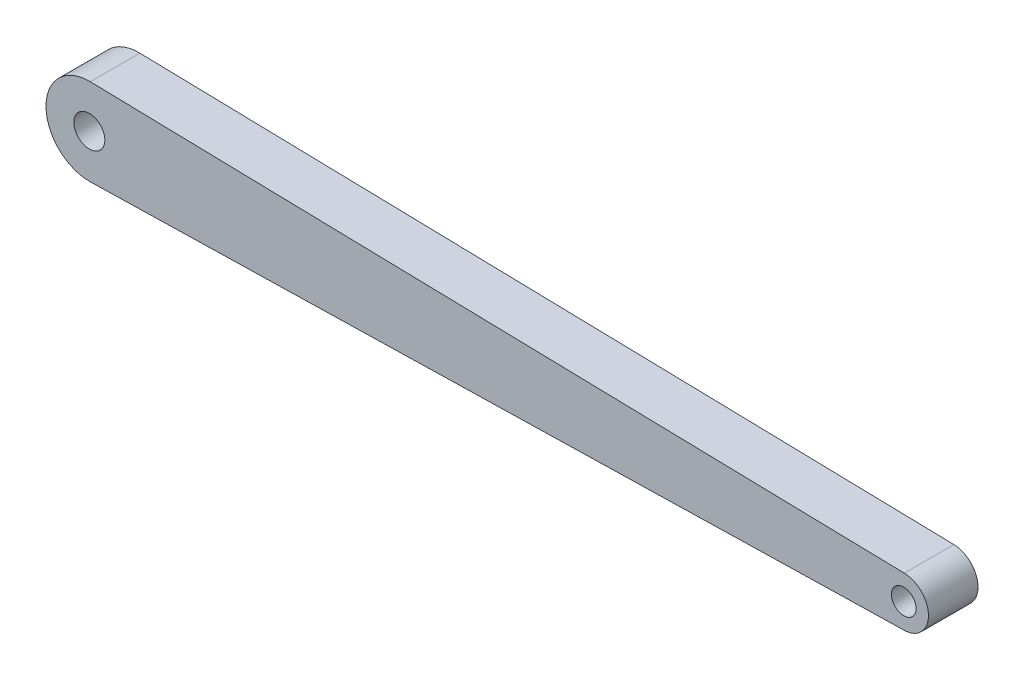
ISO-10303-21;
HEADER;
FILE_DESCRIPTION(('STEP AP214'),'2;1');
FILE_NAME('part.step','',(''),(''),'','','');
FILE_SCHEMA(('AUTOMOTIVE_DESIGN { 1 0 10303 214 1 1 1 1 }'));
ENDSEC;
DATA;
#1=APPLICATION_CONTEXT('core data for automotive mechanical design processes');
#2=APPLICATION_PROTOCOL_DEFINITION('international standard','automotive_design',2000,#1);
#3=PRODUCT_CONTEXT('',#1,'mechanical');
#4=PRODUCT('Part','Part','',(#3));
#5=PRODUCT_RELATED_PRODUCT_CATEGORY('part','',(#4));
#6=PRODUCT_DEFINITION_FORMATION('','',#4);
#7=PRODUCT_DEFINITION_CONTEXT('part definition',#1,'design');
#8=PRODUCT_DEFINITION('design','',#6,#7);
#9=PRODUCT_DEFINITION_SHAPE('','',#8);
#10=(LENGTH_UNIT() NAMED_UNIT(*) SI_UNIT(.MILLI.,.METRE.));
#11=(NAMED_UNIT(*) PLANE_ANGLE_UNIT() SI_UNIT($,.RADIAN.));
#12=(NAMED_UNIT(*) SI_UNIT($,.STERADIAN.) SOLID_ANGLE_UNIT());
#13=UNCERTAINTY_MEASURE_WITH_UNIT(LENGTH_MEASURE(1.E-05),#10,'distance_accuracy_value','');
#14=(GEOMETRIC_REPRESENTATION_CONTEXT(3) GLOBAL_UNCERTAINTY_ASSIGNED_CONTEXT((#13)) GLOBAL_UNIT_ASSIGNED_CONTEXT((#10,
#11,#12)) REPRESENTATION_CONTEXT('',''));
#15=CARTESIAN_POINT('',(0.,0.,0.));
#16=DIRECTION('',(0.,0.,1.));
#17=DIRECTION('',(1.,0.,0.));
#18=AXIS2_PLACEMENT_3D('',#15,#16,#17);
#19=CARTESIAN_POINT('',(-1315.,0.,40.));
#20=DIRECTION('',(0.,0.,1.));
#21=DIRECTION('',(1.,0.,0.));
#22=AXIS2_PLACEMENT_3D('',#19,#20,#21);
#23=PLANE('',#22);
#24=CARTESIAN_POINT('',(0.,0.,40.));
#25=DIRECTION('',(0.,0.,1.));
#26=DIRECTION('',(1.,0.,0.));
#27=AXIS2_PLACEMENT_3D('',#24,#25,#26);
#28=CIRCLE('',#27,20.);
#29=CARTESIAN_POINT('',(20.,0.,40.));
#30=VERTEX_POINT('',#29);
#31=EDGE_CURVE('E112',#30,#30,#28,.T.);
#32=ORIENTED_EDGE('',*,*,#31,.F.);
#33=EDGE_LOOP('',(#32));
#34=FACE_BOUND('',#33,.T.);
#35=CARTESIAN_POINT('',(-1315.,0.,40.));
#36=DIRECTION('',(0.,0.,1.));
#37=DIRECTION('',(1.,0.,0.));
#38=AXIS2_PLACEMENT_3D('',#35,#36,#37);
#39=CIRCLE('',#38,70.);
#40=CARTESIAN_POINT('',(-1313.40304182509,69.9817813762096,40.));
#41=VERTEX_POINT('',#40);
#42=CARTESIAN_POINT('',(-1313.40304182509,-69.9817813762097,40.));
#43=VERTEX_POINT('',#42);
#44=EDGE_CURVE('E92',#41,#43,#39,.T.);
#45=ORIENTED_EDGE('',*,*,#44,.T.);
#46=DIRECTION('',(0.999739733945852,0.0228136882129277,0.));
#47=VECTOR('',#46,1.);
#48=CARTESIAN_POINT('',(-1313.40304182509,-69.9817813762097,40.));
#49=LINE('',#48,#47);
#50=CARTESIAN_POINT('',(0.912547528517138,-39.9895893578341,40.));
#51=VERTEX_POINT('',#50);
#52=EDGE_CURVE('E87',#43,#51,#49,.T.);
#53=ORIENTED_EDGE('',*,*,#52,.T.);
#54=CARTESIAN_POINT('',(0.,0.,40.));
#55=DIRECTION('',(0.,0.,1.));
#56=DIRECTION('',(-1.,0.,0.));
#57=AXIS2_PLACEMENT_3D('',#54,#55,#56);
#58=CIRCLE('',#57,40.);
#59=CARTESIAN_POINT('',(0.912547528517112,39.9895893578341,40.));
#60=VERTEX_POINT('',#59);
#61=EDGE_CURVE('E90',#51,#60,#58,.T.);
#62=ORIENTED_EDGE('',*,*,#61,.T.);
#63=DIRECTION('',(-0.999739733945852,0.0228136882129278,0.));
#64=VECTOR('',#63,1.);
#65=CARTESIAN_POINT('',(-1313.40304182509,69.9817813762096,40.));
#66=LINE('',#65,#64);
#67=EDGE_CURVE('E57',#60,#41,#66,.T.);
#68=ORIENTED_EDGE('',*,*,#67,.T.);
#69=EDGE_LOOP('',(#45,#53,#62,#68));
#70=FACE_BOUND('',#69,.T.);
#71=CARTESIAN_POINT('',(-1315.,0.,40.));
#72=DIRECTION('',(0.,0.,1.));
#73=DIRECTION('',(1.,0.,0.));
#74=AXIS2_PLACEMENT_3D('',#71,#72,#73);
#75=CIRCLE('',#74,25.);
#76=CARTESIAN_POINT('',(-1290.,0.,40.));
#77=VERTEX_POINT('',#76);
#78=EDGE_CURVE('E134',#77,#77,#75,.T.);
#79=ORIENTED_EDGE('',*,*,#78,.F.);
#80=EDGE_LOOP('',(#79));
#81=FACE_BOUND('',#80,.T.);
#82=ADVANCED_FACE('F39',(#34,#70,#81),#23,.T.);
#83=CARTESIAN_POINT('',(-1315.,0.,-40.));
#84=DIRECTION('',(0.,0.,1.));
#85=DIRECTION('',(1.,0.,0.));
#86=AXIS2_PLACEMENT_3D('',#83,#84,#85);
#87=PLANE('',#86);
#88=CARTESIAN_POINT('',(-1315.,0.,-40.));
#89=DIRECTION('',(0.,0.,1.));
#90=DIRECTION('',(1.,0.,0.));
#91=AXIS2_PLACEMENT_3D('',#88,#89,#90);
#92=CIRCLE('',#91,70.);
#93=CARTESIAN_POINT('',(-1313.40304182509,69.9817813762096,-40.));
#94=VERTEX_POINT('',#93);
#95=CARTESIAN_POINT('',(-1313.40304182509,-69.9817813762097,-40.));
#96=VERTEX_POINT('',#95);
#97=EDGE_CURVE('E108',#94,#96,#92,.T.);
#98=ORIENTED_EDGE('',*,*,#97,.F.);
#99=DIRECTION('',(-0.999739733945852,0.0228136882129278,0.));
#100=VECTOR('',#99,1.);
#101=CARTESIAN_POINT('',(-1313.40304182509,69.9817813762096,-40.));
#102=LINE('',#101,#100);
#103=CARTESIAN_POINT('',(0.912547528517112,39.9895893578341,-40.));
#104=VERTEX_POINT('',#103);
#105=EDGE_CURVE('E80',#104,#94,#102,.T.);
#106=ORIENTED_EDGE('',*,*,#105,.F.);
#107=CARTESIAN_POINT('',(0.,0.,-40.));
#108=DIRECTION('',(0.,0.,1.));
#109=DIRECTION('',(-1.,0.,0.));
#110=AXIS2_PLACEMENT_3D('',#107,#108,#109);
#111=CIRCLE('',#110,40.);
#112=CARTESIAN_POINT('',(0.912547528517138,-39.9895893578341,-40.));
#113=VERTEX_POINT('',#112);
#114=EDGE_CURVE('E74',#113,#104,#111,.T.);
#115=ORIENTED_EDGE('',*,*,#114,.F.);
#116=DIRECTION('',(0.999739733945852,0.0228136882129277,0.));
#117=VECTOR('',#116,1.);
#118=CARTESIAN_POINT('',(-1313.40304182509,-69.9817813762097,-40.));
#119=LINE('',#118,#117);
#120=EDGE_CURVE('E97',#96,#113,#119,.T.);
#121=ORIENTED_EDGE('',*,*,#120,.F.);
#122=EDGE_LOOP('',(#98,#106,#115,#121));
#123=FACE_BOUND('',#122,.T.);
#124=CARTESIAN_POINT('',(0.,0.,-40.));
#125=DIRECTION('',(0.,0.,1.));
#126=DIRECTION('',(1.,0.,0.));
#127=AXIS2_PLACEMENT_3D('',#124,#125,#126);
#128=CIRCLE('',#127,20.);
#129=CARTESIAN_POINT('',(20.,0.,-40.));
#130=VERTEX_POINT('',#129);
#131=EDGE_CURVE('E130',#130,#130,#128,.T.);
#132=ORIENTED_EDGE('',*,*,#131,.T.);
#133=EDGE_LOOP('',(#132));
#134=FACE_BOUND('',#133,.T.);
#135=CARTESIAN_POINT('',(-1315.,0.,-40.));
#136=DIRECTION('',(0.,0.,1.));
#137=DIRECTION('',(1.,0.,0.));
#138=AXIS2_PLACEMENT_3D('',#135,#136,#137);
#139=CIRCLE('',#138,25.);
#140=CARTESIAN_POINT('',(-1290.,0.,-40.));
#141=VERTEX_POINT('',#140);
#142=EDGE_CURVE('E138',#141,#141,#139,.T.);
#143=ORIENTED_EDGE('',*,*,#142,.T.);
#144=EDGE_LOOP('',(#143));
#145=FACE_BOUND('',#144,.T.);
#146=ADVANCED_FACE('F125',(#123,#134,#145),#87,.F.);
#147=CARTESIAN_POINT('',(-1315.,0.,40.));
#148=DIRECTION('',(0.,0.,-1.));
#149=DIRECTION('',(-1.,0.,0.));
#150=AXIS2_PLACEMENT_3D('',#147,#148,#149);
#151=CYLINDRICAL_SURFACE('',#150,70.);
#152=ORIENTED_EDGE('',*,*,#97,.T.);
#153=DIRECTION('',(0.,0.,-1.));
#154=VECTOR('',#153,1.);
#155=CARTESIAN_POINT('',(-1313.40304182509,-69.9817813762097,40.));
#156=LINE('',#155,#154);
#157=EDGE_CURVE('E11',#43,#96,#156,.T.);
#158=ORIENTED_EDGE('',*,*,#157,.F.);
#159=ORIENTED_EDGE('',*,*,#44,.F.);
#160=DIRECTION('',(0.,0.,-1.));
#161=VECTOR('',#160,1.);
#162=CARTESIAN_POINT('',(-1313.40304182509,69.9817813762096,40.));
#163=LINE('',#162,#161);
#164=EDGE_CURVE('E104',#41,#94,#163,.T.);
#165=ORIENTED_EDGE('',*,*,#164,.T.);
#166=EDGE_LOOP('',(#152,#158,#159,#165));
#167=FACE_BOUND('',#166,.T.);
#168=ADVANCED_FACE('F41',(#167),#151,.T.);
#169=CARTESIAN_POINT('',(-1313.40304182509,-69.9817813762097,40.));
#170=DIRECTION('',(-0.0228136882129277,0.999739733945852,0.));
#171=DIRECTION('',(-0.999739733945852,-0.0228136882129277,0.));
#172=AXIS2_PLACEMENT_3D('',#169,#170,#171);
#173=PLANE('',#172);
#174=ORIENTED_EDGE('',*,*,#120,.T.);
#175=DIRECTION('',(0.,0.,-1.));
#176=VECTOR('',#175,1.);
#177=CARTESIAN_POINT('',(0.912547528517138,-39.9895893578341,40.));
#178=LINE('',#177,#176);
#179=EDGE_CURVE('E49',#51,#113,#178,.T.);
#180=ORIENTED_EDGE('',*,*,#179,.F.);
#181=ORIENTED_EDGE('',*,*,#52,.F.);
#182=ORIENTED_EDGE('',*,*,#157,.T.);
#183=EDGE_LOOP('',(#174,#180,#181,#182));
#184=FACE_BOUND('',#183,.T.);
#185=ADVANCED_FACE('F96',(#184),#173,.F.);
#186=CARTESIAN_POINT('',(0.,0.,40.));
#187=DIRECTION('',(0.,0.,-1.));
#188=DIRECTION('',(-1.,0.,0.));
#189=AXIS2_PLACEMENT_3D('',#186,#187,#188);
#190=CYLINDRICAL_SURFACE('',#189,40.);
#191=ORIENTED_EDGE('',*,*,#114,.T.);
#192=DIRECTION('',(0.,0.,-1.));
#193=VECTOR('',#192,1.);
#194=CARTESIAN_POINT('',(0.912547528517112,39.9895893578341,40.));
#195=LINE('',#194,#193);
#196=EDGE_CURVE('E99',#60,#104,#195,.T.);
#197=ORIENTED_EDGE('',*,*,#196,.F.);
#198=ORIENTED_EDGE('',*,*,#61,.F.);
#199=ORIENTED_EDGE('',*,*,#179,.T.);
#200=EDGE_LOOP('',(#191,#197,#198,#199));
#201=FACE_BOUND('',#200,.T.);
#202=ADVANCED_FACE('F100',(#201),#190,.T.);
#203=CARTESIAN_POINT('',(-1313.40304182509,69.9817813762096,40.));
#204=DIRECTION('',(-0.0228136882129278,-0.999739733945852,0.));
#205=DIRECTION('',(0.999739733945852,-0.0228136882129278,0.));
#206=AXIS2_PLACEMENT_3D('',#203,#204,#205);
#207=PLANE('',#206);
#208=ORIENTED_EDGE('',*,*,#105,.T.);
#209=ORIENTED_EDGE('',*,*,#164,.F.);
#210=ORIENTED_EDGE('',*,*,#67,.F.);
#211=ORIENTED_EDGE('',*,*,#196,.T.);
#212=EDGE_LOOP('',(#208,#209,#210,#211));
#213=FACE_BOUND('',#212,.T.);
#214=ADVANCED_FACE('F122',(#213),#207,.F.);
#215=CARTESIAN_POINT('',(0.,0.,40.));
#216=DIRECTION('',(0.,0.,-1.));
#217=DIRECTION('',(-1.,0.,0.));
#218=AXIS2_PLACEMENT_3D('',#215,#216,#217);
#219=CYLINDRICAL_SURFACE('',#218,20.);
#220=ORIENTED_EDGE('',*,*,#31,.T.);
#221=EDGE_LOOP('',(#220));
#222=FACE_BOUND('',#221,.T.);
#223=ORIENTED_EDGE('',*,*,#131,.F.);
#224=EDGE_LOOP('',(#223));
#225=FACE_BOUND('',#224,.T.);
#226=ADVANCED_FACE('F157',(#222,#225),#219,.F.);
#227=CARTESIAN_POINT('',(-1315.,0.,40.));
#228=DIRECTION('',(0.,0.,-1.));
#229=DIRECTION('',(-1.,0.,0.));
#230=AXIS2_PLACEMENT_3D('',#227,#228,#229);
#231=CYLINDRICAL_SURFACE('',#230,25.);
#232=ORIENTED_EDGE('',*,*,#78,.T.);
#233=EDGE_LOOP('',(#232));
#234=FACE_BOUND('',#233,.T.);
#235=ORIENTED_EDGE('',*,*,#142,.F.);
#236=EDGE_LOOP('',(#235));
#237=FACE_BOUND('',#236,.T.);
#238=ADVANCED_FACE('F146',(#234,#237),#231,.F.);
#239=CLOSED_SHELL('',(#82,#146,#168,#185,#202,#214,#226,#238));
#240=MANIFOLD_SOLID_BREP('B2',#239);
#241=ADVANCED_BREP_SHAPE_REPRESENTATION('',(#18,#240),#14);
#242=SHAPE_DEFINITION_REPRESENTATION(#9,#241);
ENDSEC;
END-ISO-10303-21;
